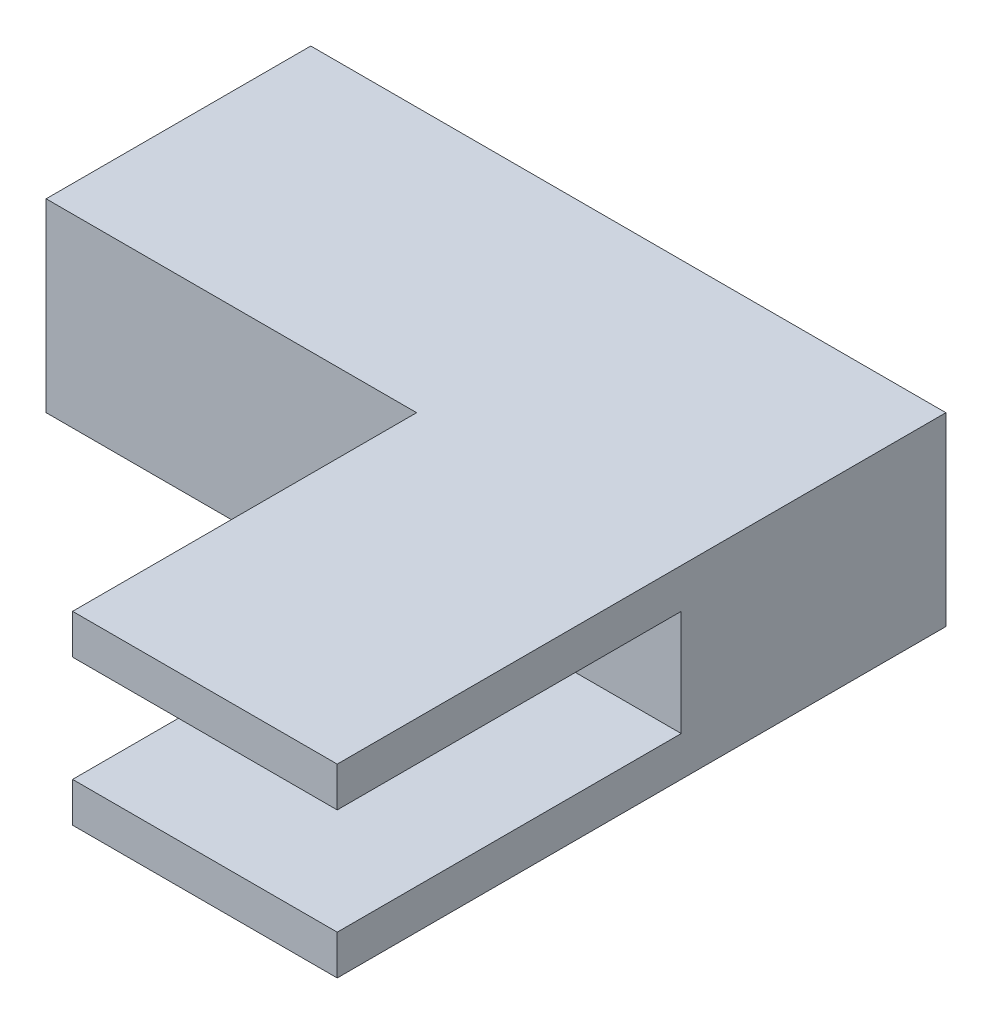
ISO-10303-21;
HEADER;
FILE_DESCRIPTION(('STEP AP214'),'2;1');
FILE_NAME('part.step','',(''),(''),'','','');
FILE_SCHEMA(('AUTOMOTIVE_DESIGN { 1 0 10303 214 1 1 1 1 }'));
ENDSEC;
DATA;
#1=APPLICATION_CONTEXT('core data for automotive mechanical design processes');
#2=APPLICATION_PROTOCOL_DEFINITION('international standard','automotive_design',2000,#1);
#3=PRODUCT_CONTEXT('',#1,'mechanical');
#4=PRODUCT('Part','Part','',(#3));
#5=PRODUCT_RELATED_PRODUCT_CATEGORY('part','',(#4));
#6=PRODUCT_DEFINITION_FORMATION('','',#4);
#7=PRODUCT_DEFINITION_CONTEXT('part definition',#1,'design');
#8=PRODUCT_DEFINITION('design','',#6,#7);
#9=PRODUCT_DEFINITION_SHAPE('','',#8);
#10=(LENGTH_UNIT() NAMED_UNIT(*) SI_UNIT(.MILLI.,.METRE.));
#11=(NAMED_UNIT(*) PLANE_ANGLE_UNIT() SI_UNIT($,.RADIAN.));
#12=(NAMED_UNIT(*) SI_UNIT($,.STERADIAN.) SOLID_ANGLE_UNIT());
#13=UNCERTAINTY_MEASURE_WITH_UNIT(LENGTH_MEASURE(1.E-05),#10,'distance_accuracy_value','');
#14=(GEOMETRIC_REPRESENTATION_CONTEXT(3) GLOBAL_UNCERTAINTY_ASSIGNED_CONTEXT((#13)) GLOBAL_UNIT_ASSIGNED_CONTEXT((#10,
#11,#12)) REPRESENTATION_CONTEXT('',''));
#15=CARTESIAN_POINT('',(0.,0.,0.));
#16=DIRECTION('',(0.,0.,1.));
#17=DIRECTION('',(1.,0.,0.));
#18=AXIS2_PLACEMENT_3D('',#15,#16,#17);
#19=CARTESIAN_POINT('',(2.,-7.,0.));
#20=DIRECTION('',(1.,0.,0.));
#21=DIRECTION('',(0.,0.,-1.));
#22=AXIS2_PLACEMENT_3D('',#19,#20,#21);
#23=PLANE('',#22);
#24=DIRECTION('',(0.,1.,0.));
#25=VECTOR('',#24,1.);
#26=CARTESIAN_POINT('',(2.,-7.,11.5));
#27=LINE('',#26,#25);
#28=CARTESIAN_POINT('',(2.,-7.,11.5));
#29=VERTEX_POINT('',#28);
#30=CARTESIAN_POINT('',(2.,-5.5,11.5));
#31=VERTEX_POINT('',#30);
#32=EDGE_CURVE('E99',#29,#31,#27,.T.);
#33=ORIENTED_EDGE('',*,*,#32,.T.);
#34=DIRECTION('',(0.,0.,-1.));
#35=VECTOR('',#34,1.);
#36=CARTESIAN_POINT('',(2.,-5.5,0.));
#37=LINE('',#36,#35);
#38=CARTESIAN_POINT('',(2.,-5.5,-1.5));
#39=VERTEX_POINT('',#38);
#40=EDGE_CURVE('E141',#31,#39,#37,.T.);
#41=ORIENTED_EDGE('',*,*,#40,.T.);
#42=DIRECTION('',(0.,1.,0.));
#43=VECTOR('',#42,1.);
#44=CARTESIAN_POINT('',(2.,-7.,-1.5));
#45=LINE('',#44,#43);
#46=CARTESIAN_POINT('',(2.,-7.,-1.5));
#47=VERTEX_POINT('',#46);
#48=EDGE_CURVE('E45',#47,#39,#45,.T.);
#49=ORIENTED_EDGE('',*,*,#48,.F.);
#50=DIRECTION('',(0.,0.,-1.));
#51=VECTOR('',#50,1.);
#52=CARTESIAN_POINT('',(2.,-7.,0.));
#53=LINE('',#52,#51);
#54=EDGE_CURVE('E61',#29,#47,#53,.T.);
#55=ORIENTED_EDGE('',*,*,#54,.F.);
#56=EDGE_LOOP('',(#33,#41,#49,#55));
#57=FACE_BOUND('',#56,.T.);
#58=ADVANCED_FACE('F37',(#57),#23,.F.);
#59=CARTESIAN_POINT('',(0.,-7.,11.5));
#60=DIRECTION('',(0.,0.,1.));
#61=DIRECTION('',(1.,0.,0.));
#62=AXIS2_PLACEMENT_3D('',#59,#60,#61);
#63=PLANE('',#62);
#64=DIRECTION('',(1.,0.,0.));
#65=VECTOR('',#64,1.);
#66=CARTESIAN_POINT('',(0.,-5.5,11.5));
#67=LINE('',#66,#65);
#68=CARTESIAN_POINT('',(12.,-5.5,11.5));
#69=VERTEX_POINT('',#68);
#70=EDGE_CURVE('E11',#31,#69,#67,.T.);
#71=ORIENTED_EDGE('',*,*,#70,.F.);
#72=ORIENTED_EDGE('',*,*,#32,.F.);
#73=DIRECTION('',(1.,0.,0.));
#74=VECTOR('',#73,1.);
#75=CARTESIAN_POINT('',(0.,-7.,11.5));
#76=LINE('',#75,#74);
#77=CARTESIAN_POINT('',(12.,-7.,11.5));
#78=VERTEX_POINT('',#77);
#79=EDGE_CURVE('E196',#29,#78,#76,.T.);
#80=ORIENTED_EDGE('',*,*,#79,.T.);
#81=DIRECTION('',(0.,1.,0.));
#82=VECTOR('',#81,1.);
#83=CARTESIAN_POINT('',(12.,-7.,11.5));
#84=LINE('',#83,#82);
#85=EDGE_CURVE('E157',#78,#69,#84,.T.);
#86=ORIENTED_EDGE('',*,*,#85,.T.);
#87=EDGE_LOOP('',(#71,#72,#80,#86));
#88=FACE_BOUND('',#87,.T.);
#89=ADVANCED_FACE('F201',(#88),#63,.T.);
#90=CARTESIAN_POINT('',(2.,-1.5,-1.5));
#91=VERTEX_POINT('',#90);
#92=CARTESIAN_POINT('',(2.,0.,-1.5));
#93=VERTEX_POINT('',#92);
#94=EDGE_CURVE('E90',#91,#93,#45,.T.);
#95=ORIENTED_EDGE('',*,*,#94,.F.);
#96=DIRECTION('',(0.,0.,1.));
#97=VECTOR('',#96,1.);
#98=CARTESIAN_POINT('',(2.,-1.5,0.));
#99=LINE('',#98,#97);
#100=CARTESIAN_POINT('',(2.,-1.5,11.5));
#101=VERTEX_POINT('',#100);
#102=EDGE_CURVE('E168',#91,#101,#99,.T.);
#103=ORIENTED_EDGE('',*,*,#102,.T.);
#104=CARTESIAN_POINT('',(2.,0.,11.5));
#105=VERTEX_POINT('',#104);
#106=EDGE_CURVE('E134',#101,#105,#27,.T.);
#107=ORIENTED_EDGE('',*,*,#106,.T.);
#108=DIRECTION('',(0.,0.,-1.));
#109=VECTOR('',#108,1.);
#110=CARTESIAN_POINT('',(2.,0.,0.));
#111=LINE('',#110,#109);
#112=EDGE_CURVE('E138',#105,#93,#111,.T.);
#113=ORIENTED_EDGE('',*,*,#112,.T.);
#114=EDGE_LOOP('',(#95,#103,#107,#113));
#115=FACE_BOUND('',#114,.T.);
#116=ADVANCED_FACE('F39',(#115),#23,.F.);
#117=CARTESIAN_POINT('',(0.,-7.,-1.5));
#118=DIRECTION('',(0.,0.,1.));
#119=DIRECTION('',(1.,0.,0.));
#120=AXIS2_PLACEMENT_3D('',#117,#118,#119);
#121=PLANE('',#120);
#122=DIRECTION('',(1.,0.,0.));
#123=VECTOR('',#122,1.);
#124=CARTESIAN_POINT('',(0.,0.,-1.5));
#125=LINE('',#124,#123);
#126=CARTESIAN_POINT('',(-12.,0.,-1.5));
#127=VERTEX_POINT('',#126);
#128=EDGE_CURVE('E150',#127,#93,#125,.T.);
#129=ORIENTED_EDGE('',*,*,#128,.F.);
#130=DIRECTION('',(0.,1.,0.));
#131=VECTOR('',#130,1.);
#132=CARTESIAN_POINT('',(-12.,-7.,-1.5));
#133=LINE('',#132,#131);
#134=CARTESIAN_POINT('',(-12.,-7.,-1.5));
#135=VERTEX_POINT('',#134);
#136=EDGE_CURVE('E120',#135,#127,#133,.T.);
#137=ORIENTED_EDGE('',*,*,#136,.F.);
#138=DIRECTION('',(1.,0.,0.));
#139=VECTOR('',#138,1.);
#140=CARTESIAN_POINT('',(0.,-7.,-1.5));
#141=LINE('',#140,#139);
#142=EDGE_CURVE('E132',#135,#47,#141,.T.);
#143=ORIENTED_EDGE('',*,*,#142,.T.);
#144=ORIENTED_EDGE('',*,*,#48,.T.);
#145=DIRECTION('',(-1.,0.,0.));
#146=VECTOR('',#145,1.);
#147=CARTESIAN_POINT('',(12.,-5.5,-1.5));
#148=LINE('',#147,#146);
#149=CARTESIAN_POINT('',(12.,-5.5,-1.5));
#150=VERTEX_POINT('',#149);
#151=EDGE_CURVE('E186',#150,#39,#148,.T.);
#152=ORIENTED_EDGE('',*,*,#151,.F.);
#153=DIRECTION('',(0.,-1.,0.));
#154=VECTOR('',#153,1.);
#155=CARTESIAN_POINT('',(12.,-1.5,-1.5));
#156=LINE('',#155,#154);
#157=CARTESIAN_POINT('',(12.,-1.5,-1.5));
#158=VERTEX_POINT('',#157);
#159=EDGE_CURVE('E243',#158,#150,#156,.T.);
#160=ORIENTED_EDGE('',*,*,#159,.F.);
#161=DIRECTION('',(1.,0.,0.));
#162=VECTOR('',#161,1.);
#163=CARTESIAN_POINT('',(12.,-1.5,-1.5));
#164=LINE('',#163,#162);
#165=EDGE_CURVE('E191',#91,#158,#164,.T.);
#166=ORIENTED_EDGE('',*,*,#165,.F.);
#167=ORIENTED_EDGE('',*,*,#94,.T.);
#168=EDGE_LOOP('',(#129,#137,#143,#144,#152,#160,#166,#167));
#169=FACE_BOUND('',#168,.T.);
#170=ADVANCED_FACE('F180',(#169),#121,.T.);
#171=CARTESIAN_POINT('',(-12.,-7.,0.));
#172=DIRECTION('',(-1.,0.,0.));
#173=DIRECTION('',(0.,0.,1.));
#174=AXIS2_PLACEMENT_3D('',#171,#172,#173);
#175=PLANE('',#174);
#176=DIRECTION('',(0.,0.,1.));
#177=VECTOR('',#176,1.);
#178=CARTESIAN_POINT('',(-12.,0.,0.));
#179=LINE('',#178,#177);
#180=CARTESIAN_POINT('',(-12.,0.,-11.5));
#181=VERTEX_POINT('',#180);
#182=EDGE_CURVE('E117',#181,#127,#179,.T.);
#183=ORIENTED_EDGE('',*,*,#182,.F.);
#184=DIRECTION('',(0.,1.,0.));
#185=VECTOR('',#184,1.);
#186=CARTESIAN_POINT('',(-12.,-7.,-11.5));
#187=LINE('',#186,#185);
#188=CARTESIAN_POINT('',(-12.,-7.,-11.5));
#189=VERTEX_POINT('',#188);
#190=EDGE_CURVE('E111',#189,#181,#187,.T.);
#191=ORIENTED_EDGE('',*,*,#190,.F.);
#192=DIRECTION('',(0.,0.,1.));
#193=VECTOR('',#192,1.);
#194=CARTESIAN_POINT('',(-12.,-7.,0.));
#195=LINE('',#194,#193);
#196=EDGE_CURVE('E115',#189,#135,#195,.T.);
#197=ORIENTED_EDGE('',*,*,#196,.T.);
#198=ORIENTED_EDGE('',*,*,#136,.T.);
#199=EDGE_LOOP('',(#183,#191,#197,#198));
#200=FACE_BOUND('',#199,.T.);
#201=ADVANCED_FACE('F113',(#200),#175,.T.);
#202=CARTESIAN_POINT('',(0.,-7.,-11.5));
#203=DIRECTION('',(0.,0.,1.));
#204=DIRECTION('',(1.,0.,0.));
#205=AXIS2_PLACEMENT_3D('',#202,#203,#204);
#206=PLANE('',#205);
#207=DIRECTION('',(1.,0.,0.));
#208=VECTOR('',#207,1.);
#209=CARTESIAN_POINT('',(0.,0.,-11.5));
#210=LINE('',#209,#208);
#211=CARTESIAN_POINT('',(12.,0.,-11.5));
#212=VERTEX_POINT('',#211);
#213=EDGE_CURVE('E147',#181,#212,#210,.T.);
#214=ORIENTED_EDGE('',*,*,#213,.T.);
#215=DIRECTION('',(0.,1.,0.));
#216=VECTOR('',#215,1.);
#217=CARTESIAN_POINT('',(12.,-7.,-11.5));
#218=LINE('',#217,#216);
#219=CARTESIAN_POINT('',(12.,-7.,-11.5));
#220=VERTEX_POINT('',#219);
#221=EDGE_CURVE('E121',#220,#212,#218,.T.);
#222=ORIENTED_EDGE('',*,*,#221,.F.);
#223=DIRECTION('',(1.,0.,0.));
#224=VECTOR('',#223,1.);
#225=CARTESIAN_POINT('',(0.,-7.,-11.5));
#226=LINE('',#225,#224);
#227=EDGE_CURVE('E124',#189,#220,#226,.T.);
#228=ORIENTED_EDGE('',*,*,#227,.F.);
#229=ORIENTED_EDGE('',*,*,#190,.T.);
#230=EDGE_LOOP('',(#214,#222,#228,#229));
#231=FACE_BOUND('',#230,.T.);
#232=ADVANCED_FACE('F125',(#231),#206,.F.);
#233=CARTESIAN_POINT('',(12.,-7.,0.));
#234=DIRECTION('',(-1.,0.,0.));
#235=DIRECTION('',(0.,0.,1.));
#236=AXIS2_PLACEMENT_3D('',#233,#234,#235);
#237=PLANE('',#236);
#238=ORIENTED_EDGE('',*,*,#159,.T.);
#239=DIRECTION('',(0.,0.,1.));
#240=VECTOR('',#239,1.);
#241=CARTESIAN_POINT('',(12.,-5.5,-25.8310501211929));
#242=LINE('',#241,#240);
#243=EDGE_CURVE('E200',#150,#69,#242,.T.);
#244=ORIENTED_EDGE('',*,*,#243,.T.);
#245=ORIENTED_EDGE('',*,*,#85,.F.);
#246=DIRECTION('',(0.,0.,1.));
#247=VECTOR('',#246,1.);
#248=CARTESIAN_POINT('',(12.,-7.,0.));
#249=LINE('',#248,#247);
#250=EDGE_CURVE('E128',#220,#78,#249,.T.);
#251=ORIENTED_EDGE('',*,*,#250,.F.);
#252=ORIENTED_EDGE('',*,*,#221,.T.);
#253=DIRECTION('',(0.,0.,1.));
#254=VECTOR('',#253,1.);
#255=CARTESIAN_POINT('',(12.,0.,0.));
#256=LINE('',#255,#254);
#257=CARTESIAN_POINT('',(12.,0.,11.5));
#258=VERTEX_POINT('',#257);
#259=EDGE_CURVE('E144',#212,#258,#256,.T.);
#260=ORIENTED_EDGE('',*,*,#259,.T.);
#261=CARTESIAN_POINT('',(12.,-1.5,11.5));
#262=VERTEX_POINT('',#261);
#263=EDGE_CURVE('E159',#262,#258,#84,.T.);
#264=ORIENTED_EDGE('',*,*,#263,.F.);
#265=DIRECTION('',(0.,0.,1.));
#266=VECTOR('',#265,1.);
#267=CARTESIAN_POINT('',(12.,-1.5,-25.8310501211929));
#268=LINE('',#267,#266);
#269=EDGE_CURVE('E52',#158,#262,#268,.T.);
#270=ORIENTED_EDGE('',*,*,#269,.F.);
#271=EDGE_LOOP('',(#238,#244,#245,#251,#252,#260,#264,#270));
#272=FACE_BOUND('',#271,.T.);
#273=ADVANCED_FACE('F179',(#272),#237,.F.);
#274=DIRECTION('',(-1.,0.,0.));
#275=VECTOR('',#274,1.);
#276=CARTESIAN_POINT('',(12.,-1.5,11.5));
#277=LINE('',#276,#275);
#278=EDGE_CURVE('E176',#262,#101,#277,.T.);
#279=ORIENTED_EDGE('',*,*,#278,.F.);
#280=ORIENTED_EDGE('',*,*,#263,.T.);
#281=DIRECTION('',(1.,0.,0.));
#282=VECTOR('',#281,1.);
#283=CARTESIAN_POINT('',(0.,0.,11.5));
#284=LINE('',#283,#282);
#285=EDGE_CURVE('E140',#105,#258,#284,.T.);
#286=ORIENTED_EDGE('',*,*,#285,.F.);
#287=ORIENTED_EDGE('',*,*,#106,.F.);
#288=EDGE_LOOP('',(#279,#280,#286,#287));
#289=FACE_BOUND('',#288,.T.);
#290=ADVANCED_FACE('F174',(#289),#63,.T.);
#291=CARTESIAN_POINT('',(0.,-7.,0.));
#292=DIRECTION('',(0.,1.,0.));
#293=DIRECTION('',(0.,0.,1.));
#294=AXIS2_PLACEMENT_3D('',#291,#292,#293);
#295=PLANE('',#294);
#296=ORIENTED_EDGE('',*,*,#54,.T.);
#297=ORIENTED_EDGE('',*,*,#142,.F.);
#298=ORIENTED_EDGE('',*,*,#196,.F.);
#299=ORIENTED_EDGE('',*,*,#227,.T.);
#300=ORIENTED_EDGE('',*,*,#250,.T.);
#301=ORIENTED_EDGE('',*,*,#79,.F.);
#302=EDGE_LOOP('',(#296,#297,#298,#299,#300,#301));
#303=FACE_BOUND('',#302,.T.);
#304=ADVANCED_FACE('F130',(#303),#295,.F.);
#305=CARTESIAN_POINT('',(0.,0.,0.));
#306=DIRECTION('',(0.,1.,0.));
#307=DIRECTION('',(0.,0.,1.));
#308=AXIS2_PLACEMENT_3D('',#305,#306,#307);
#309=PLANE('',#308);
#310=ORIENTED_EDGE('',*,*,#112,.F.);
#311=ORIENTED_EDGE('',*,*,#285,.T.);
#312=ORIENTED_EDGE('',*,*,#259,.F.);
#313=ORIENTED_EDGE('',*,*,#213,.F.);
#314=ORIENTED_EDGE('',*,*,#182,.T.);
#315=ORIENTED_EDGE('',*,*,#128,.T.);
#316=EDGE_LOOP('',(#310,#311,#312,#313,#314,#315));
#317=FACE_BOUND('',#316,.T.);
#318=ADVANCED_FACE('F172',(#317),#309,.T.);
#319=CARTESIAN_POINT('',(12.,-5.5,-25.8310501211929));
#320=DIRECTION('',(0.,-1.,0.));
#321=DIRECTION('',(1.,0.,0.));
#322=AXIS2_PLACEMENT_3D('',#319,#320,#321);
#323=PLANE('',#322);
#324=ORIENTED_EDGE('',*,*,#70,.T.);
#325=ORIENTED_EDGE('',*,*,#243,.F.);
#326=ORIENTED_EDGE('',*,*,#151,.T.);
#327=ORIENTED_EDGE('',*,*,#40,.F.);
#328=EDGE_LOOP('',(#324,#325,#326,#327));
#329=FACE_BOUND('',#328,.T.);
#330=ADVANCED_FACE('F224',(#329),#323,.F.);
#331=CARTESIAN_POINT('',(12.,-1.5,-25.8310501211929));
#332=DIRECTION('',(0.,1.,0.));
#333=DIRECTION('',(-1.,0.,0.));
#334=AXIS2_PLACEMENT_3D('',#331,#332,#333);
#335=PLANE('',#334);
#336=ORIENTED_EDGE('',*,*,#165,.T.);
#337=ORIENTED_EDGE('',*,*,#269,.T.);
#338=ORIENTED_EDGE('',*,*,#278,.T.);
#339=ORIENTED_EDGE('',*,*,#102,.F.);
#340=EDGE_LOOP('',(#336,#337,#338,#339));
#341=FACE_BOUND('',#340,.T.);
#342=ADVANCED_FACE('F226',(#341),#335,.F.);
#343=CLOSED_SHELL('',(#58,#89,#116,#170,#201,#232,#273,#290,#304,#318,#330,#342));
#344=MANIFOLD_SOLID_BREP('B2',#343);
#345=ADVANCED_BREP_SHAPE_REPRESENTATION('',(#18,#344),#14);
#346=SHAPE_DEFINITION_REPRESENTATION(#9,#345);
ENDSEC;
END-ISO-10303-21;
